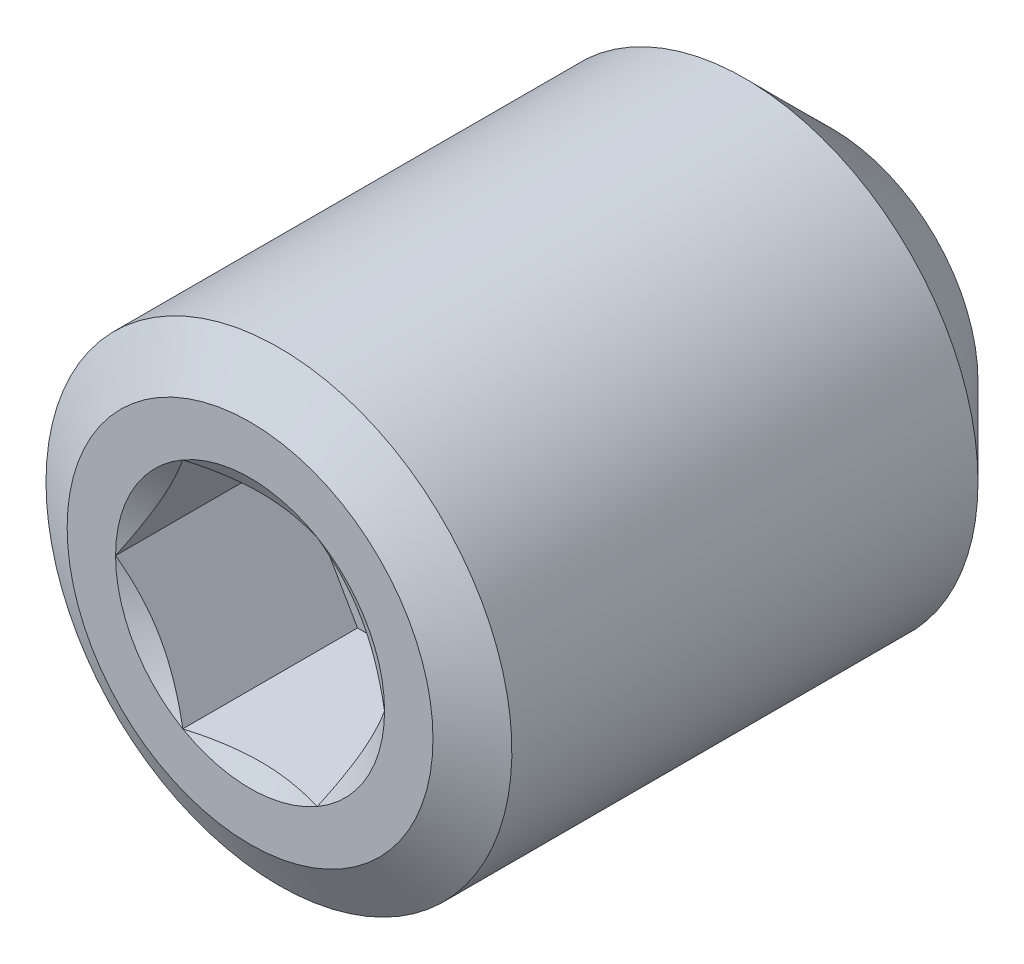
ISO-10303-21;
HEADER;
FILE_DESCRIPTION(('STEP AP214'),'2;1');
FILE_NAME('part.step','',(''),(''),'','','');
FILE_SCHEMA(('AUTOMOTIVE_DESIGN { 1 0 10303 214 1 1 1 1 }'));
ENDSEC;
DATA;
#1=APPLICATION_CONTEXT('core data for automotive mechanical design processes');
#2=APPLICATION_PROTOCOL_DEFINITION('international standard','automotive_design',2000,#1);
#3=PRODUCT_CONTEXT('',#1,'mechanical');
#4=PRODUCT('Part','Part','',(#3));
#5=PRODUCT_RELATED_PRODUCT_CATEGORY('part','',(#4));
#6=PRODUCT_DEFINITION_FORMATION('','',#4);
#7=PRODUCT_DEFINITION_CONTEXT('part definition',#1,'design');
#8=PRODUCT_DEFINITION('design','',#6,#7);
#9=PRODUCT_DEFINITION_SHAPE('','',#8);
#10=(LENGTH_UNIT() NAMED_UNIT(*) SI_UNIT(.MILLI.,.METRE.));
#11=(NAMED_UNIT(*) PLANE_ANGLE_UNIT() SI_UNIT($,.RADIAN.));
#12=(NAMED_UNIT(*) SI_UNIT($,.STERADIAN.) SOLID_ANGLE_UNIT());
#13=UNCERTAINTY_MEASURE_WITH_UNIT(LENGTH_MEASURE(1.E-05),#10,'distance_accuracy_value','');
#14=(GEOMETRIC_REPRESENTATION_CONTEXT(3) GLOBAL_UNCERTAINTY_ASSIGNED_CONTEXT((#13)) GLOBAL_UNIT_ASSIGNED_CONTEXT((#10,
#11,#12)) REPRESENTATION_CONTEXT('',''));
#15=CARTESIAN_POINT('',(0.,0.,0.));
#16=DIRECTION('',(0.,0.,1.));
#17=DIRECTION('',(1.,0.,0.));
#18=AXIS2_PLACEMENT_3D('',#15,#16,#17);
#19=CARTESIAN_POINT('',(-7.87735026918963,-0.999999999999999,10.));
#20=DIRECTION('',(0.,-1.,0.));
#21=DIRECTION('',(0.,0.,-1.));
#22=AXIS2_PLACEMENT_3D('',#19,#20,#21);
#23=PLANE('',#22);
#24=DIRECTION('',(0.,0.,1.));
#25=VECTOR('',#24,1.);
#26=CARTESIAN_POINT('',(-6.72264973081037,-0.999999999999999,10.));
#27=LINE('',#26,#25);
#28=CARTESIAN_POINT('',(-6.72264973080795,-1.00000000000603,10.0000000000346));
#29=VERTEX_POINT('',#28);
#30=CARTESIAN_POINT('',(-6.72264973081037,-0.999999999999999,8.5));
#31=VERTEX_POINT('',#30);
#32=EDGE_CURVE('E74',#29,#31,#27,.F.);
#33=ORIENTED_EDGE('',*,*,#32,.T.);
#34=DIRECTION('',(-1.,0.,0.));
#35=VECTOR('',#34,1.);
#36=CARTESIAN_POINT('',(-7.3,-0.999999999999999,8.5));
#37=LINE('',#36,#35);
#38=CARTESIAN_POINT('',(-7.87735026918963,-0.999999999999997,8.5));
#39=VERTEX_POINT('',#38);
#40=EDGE_CURVE('E261',#31,#39,#37,.T.);
#41=ORIENTED_EDGE('',*,*,#40,.T.);
#42=DIRECTION('',(0.,0.,1.));
#43=VECTOR('',#42,1.);
#44=CARTESIAN_POINT('',(-7.87735026918963,-0.999999999999997,10.));
#45=LINE('',#44,#43);
#46=CARTESIAN_POINT('',(-7.87735026919245,-0.999999999999998,10.0000000000686));
#47=VERTEX_POINT('',#46);
#48=EDGE_CURVE('E77',#39,#47,#45,.T.);
#49=ORIENTED_EDGE('',*,*,#48,.T.);
#50=CARTESIAN_POINT('',(-6.72264973081249,-0.999999999999999,10.0000000000303));
#51=CARTESIAN_POINT('',(-6.77004446291757,-0.999999999999999,9.98631688646596));
#52=CARTESIAN_POINT('',(-6.81781412942871,-0.999999999999999,9.9737896099871));
#53=CARTESIAN_POINT('',(-6.91412944760533,-0.999999999999999,9.95164920318649));
#54=CARTESIAN_POINT('',(-6.96267658445572,-0.999999999999999,9.94204259308874));
#55=CARTESIAN_POINT('',(-7.05922611584881,-0.999999999999999,9.9265940010351));
#56=CARTESIAN_POINT('',(-7.10721491698777,-0.999999999999999,9.92066965365338));
#57=CARTESIAN_POINT('',(-7.20346938392045,-0.999999999999999,9.9127165686833));
#58=CARTESIAN_POINT('',(-7.25173469196023,-0.999999999999999,9.91068360254859));
#59=CARTESIAN_POINT('',(-7.34826530804043,-0.999999999999999,9.91068360254859));
#60=CARTESIAN_POINT('',(-7.39653061608086,-0.999999999999999,9.91271656868335));
#61=CARTESIAN_POINT('',(-7.49278508301485,-0.999999999999999,9.92066965365365));
#62=CARTESIAN_POINT('',(-7.54077388415445,-0.999999999999999,9.92659400103553));
#63=CARTESIAN_POINT('',(-7.63732341554885,-0.999999999999999,9.94204259308957));
#64=CARTESIAN_POINT('',(-7.6858705523999,-0.999999999999999,9.95164920318757));
#65=CARTESIAN_POINT('',(-7.78218587057781,-0.999999999999999,9.97378960998872));
#66=CARTESIAN_POINT('',(-7.82995553708958,-0.999999999999999,9.98631688646788));
#67=CARTESIAN_POINT('',(-7.87735026919528,-0.999999999999999,10.0000000000326));
#68=B_SPLINE_CURVE_WITH_KNOTS('',3,(#50,#51,#52,#53,#54,#55,#56,#57,#58,#59,#60,#61,#62,#63,#64,
#65,#66,#67),.UNSPECIFIED.,.F.,.F.,(4,2,2,2,2,2,2,2,4),(0.,0.14803669795849,0.29640149304375,
0.44131542958406,0.586071806661001,0.730828183739914,0.875742120282205,1.02410691536954,
1.17214361333009),.UNSPECIFIED.);
#69=EDGE_CURVE('E21',#29,#47,#68,.T.);
#70=ORIENTED_EDGE('',*,*,#69,.F.);
#71=EDGE_LOOP('',(#33,#41,#49,#70));
#72=FACE_BOUND('',#71,.T.);
#73=ADVANCED_FACE('F17',(#72),#23,.F.);
#74=CARTESIAN_POINT('',(-6.72264973081037,1.,10.));
#75=DIRECTION('',(0.,1.,0.));
#76=DIRECTION('',(0.,0.,1.));
#77=AXIS2_PLACEMENT_3D('',#74,#75,#76);
#78=PLANE('',#77);
#79=DIRECTION('',(0.,0.,1.));
#80=VECTOR('',#79,1.);
#81=CARTESIAN_POINT('',(-7.87735026918963,1.,10.));
#82=LINE('',#81,#80);
#83=CARTESIAN_POINT('',(-7.87735026918372,1.00000000001023,10.0000000000431));
#84=VERTEX_POINT('',#83);
#85=CARTESIAN_POINT('',(-7.87735026918963,1.,8.5));
#86=VERTEX_POINT('',#85);
#87=EDGE_CURVE('E225',#84,#86,#82,.F.);
#88=ORIENTED_EDGE('',*,*,#87,.T.);
#89=DIRECTION('',(-1.,0.,0.));
#90=VECTOR('',#89,1.);
#91=CARTESIAN_POINT('',(-7.3,1.,8.5));
#92=LINE('',#91,#90);
#93=CARTESIAN_POINT('',(-6.72264973081037,0.999999999999999,8.5));
#94=VERTEX_POINT('',#93);
#95=EDGE_CURVE('E170',#86,#94,#92,.F.);
#96=ORIENTED_EDGE('',*,*,#95,.T.);
#97=DIRECTION('',(0.,0.,1.));
#98=VECTOR('',#97,1.);
#99=CARTESIAN_POINT('',(-6.72264973081037,0.999999999999998,10.));
#100=LINE('',#99,#98);
#101=CARTESIAN_POINT('',(-6.72264973080584,1.00000000000421,10.0000000000431));
#102=VERTEX_POINT('',#101);
#103=EDGE_CURVE('E89',#94,#102,#100,.T.);
#104=ORIENTED_EDGE('',*,*,#103,.T.);
#105=CARTESIAN_POINT('',(-7.87735026918543,1.,10.0000000000385));
#106=CARTESIAN_POINT('',(-7.82995553708064,1.,9.98631688647293));
#107=CARTESIAN_POINT('',(-7.78218587056974,1.,9.97378960999294));
#108=CARTESIAN_POINT('',(-7.68587055239344,1.,9.9516492031903));
#109=CARTESIAN_POINT('',(-7.63732341554314,1.,9.94204259309165));
#110=CARTESIAN_POINT('',(-7.54077388415032,1.,9.9265940010366));
#111=CARTESIAN_POINT('',(-7.49278508301155,1.,9.92066965365434));
#112=CARTESIAN_POINT('',(-7.39653061607918,1.,9.91271656868353));
#113=CARTESIAN_POINT('',(-7.34826530803955,1.,9.91068360254864));
#114=CARTESIAN_POINT('',(-7.25173469196029,1.,9.91068360254864));
#115=CARTESIAN_POINT('',(-7.20346938392067,1.,9.91271656868354));
#116=CARTESIAN_POINT('',(-7.10721491698833,1.,9.92066965365435));
#117=CARTESIAN_POINT('',(-7.05922611584958,1.,9.92659400103662));
#118=CARTESIAN_POINT('',(-6.96267658445678,1.,9.94204259309167));
#119=CARTESIAN_POINT('',(-6.9141294476065,1.,9.95164920319031));
#120=CARTESIAN_POINT('',(-6.81781412943023,1.,9.97378960999295));
#121=CARTESIAN_POINT('',(-6.77004446291934,1.,9.98631688647294));
#122=CARTESIAN_POINT('',(-6.72264973081457,1.,10.0000000000385));
#123=B_SPLINE_CURVE_WITH_KNOTS('',3,(#105,#106,#107,#108,#109,#110,#111,#112,#113,#114,#115,
#116,#117,#118,#119,#120,#121,#122),.UNSPECIFIED.,.F.,.F.,(4,2,2,2,2,2,2,2,4),(0.,
0.148036697958658,0.296401493044158,0.441315429584087,0.586071806660615,0.730828183737098,
0.875742120276983,1.02410691536244,1.17214361332105),.UNSPECIFIED.);
#124=EDGE_CURVE('E78',#84,#102,#123,.T.);
#125=ORIENTED_EDGE('',*,*,#124,.F.);
#126=EDGE_LOOP('',(#88,#96,#104,#125));
#127=FACE_BOUND('',#126,.T.);
#128=ADVANCED_FACE('F162',(#127),#78,.F.);
#129=CARTESIAN_POINT('',(-7.3,0.,8.5));
#130=DIRECTION('',(0.,0.,-1.));
#131=DIRECTION('',(-1.,0.,0.));
#132=AXIS2_PLACEMENT_3D('',#129,#130,#131);
#133=PLANE('',#132);
#134=ORIENTED_EDGE('',*,*,#40,.F.);
#135=DIRECTION('',(0.5,0.866025403784439,0.));
#136=VECTOR('',#135,1.);
#137=CARTESIAN_POINT('',(-6.72264973081037,-0.999999999999999,8.5));
#138=LINE('',#137,#136);
#139=CARTESIAN_POINT('',(-6.14529946162075,0.,8.5));
#140=VERTEX_POINT('',#139);
#141=EDGE_CURVE('E88',#31,#140,#138,.T.);
#142=ORIENTED_EDGE('',*,*,#141,.T.);
#143=DIRECTION('',(-0.5,0.866025403784439,0.));
#144=VECTOR('',#143,1.);
#145=CARTESIAN_POINT('',(-6.14529946162075,0.,8.5));
#146=LINE('',#145,#144);
#147=EDGE_CURVE('E251',#140,#94,#146,.T.);
#148=ORIENTED_EDGE('',*,*,#147,.T.);
#149=ORIENTED_EDGE('',*,*,#95,.F.);
#150=DIRECTION('',(-0.5,-0.866025403784439,0.));
#151=VECTOR('',#150,1.);
#152=CARTESIAN_POINT('',(-7.87735026918963,1.,8.5));
#153=LINE('',#152,#151);
#154=CARTESIAN_POINT('',(-8.45470053837925,0.,8.5));
#155=VERTEX_POINT('',#154);
#156=EDGE_CURVE('E227',#86,#155,#153,.T.);
#157=ORIENTED_EDGE('',*,*,#156,.T.);
#158=DIRECTION('',(0.5,-0.866025403784439,0.));
#159=VECTOR('',#158,1.);
#160=CARTESIAN_POINT('',(-8.45470053837925,0.,8.5));
#161=LINE('',#160,#159);
#162=EDGE_CURVE('E233',#155,#39,#161,.T.);
#163=ORIENTED_EDGE('',*,*,#162,.T.);
#164=EDGE_LOOP('',(#134,#142,#148,#149,#157,#163));
#165=FACE_BOUND('',#164,.T.);
#166=ADVANCED_FACE('F159',(#165),#133,.F.);
#167=CARTESIAN_POINT('',(-6.14529946162075,0.,10.));
#168=DIRECTION('',(0.866025403784439,0.5,0.));
#169=DIRECTION('',(-0.5,0.866025403784439,0.));
#170=AXIS2_PLACEMENT_3D('',#167,#168,#169);
#171=PLANE('',#170);
#172=ORIENTED_EDGE('',*,*,#103,.F.);
#173=ORIENTED_EDGE('',*,*,#147,.F.);
#174=DIRECTION('',(0.,0.,1.));
#175=VECTOR('',#174,1.);
#176=CARTESIAN_POINT('',(-6.14529946162075,0.,10.));
#177=LINE('',#176,#175);
#178=CARTESIAN_POINT('',(-6.14529946161431,8.97844888407203E-13,10.0000000000434));
#179=VERTEX_POINT('',#178);
#180=EDGE_CURVE('E243',#140,#179,#177,.T.);
#181=ORIENTED_EDGE('',*,*,#180,.T.);
#182=CARTESIAN_POINT('',(-6.14529946162179,1.79467155428432E-12,10.0000000000391));
#183=CARTESIAN_POINT('',(-6.17067050939324,0.0439439437832102,9.9853477726028));
#184=CARTESIAN_POINT('',(-6.19626055968811,0.0882672110621736,9.97202233858992));
#185=CARTESIAN_POINT('',(-6.24788373488103,0.177681173344338,9.94876319374054));
#186=CARTESIAN_POINT('',(-6.27391777672441,0.222773456543447,9.93883771020972));
#187=CARTESIAN_POINT('',(-6.32566323358121,0.312399216880282,9.92338797951412));
#188=CARTESIAN_POINT('',(-6.3513666891231,0.356918907808926,9.91776089383969));
#189=CARTESIAN_POINT('',(-6.40289448035908,0.446167660231436,9.91104458410664));
#190=CARTESIAN_POINT('',(-6.42871862889216,0.490896397552941,9.90994979702856));
#191=CARTESIAN_POINT('',(-6.47696828007823,0.574467244854696,9.9122331451188));
#192=CARTESIAN_POINT('',(-6.49940102298446,0.613321895321417,9.91505064264945));
#193=CARTESIAN_POINT('',(-6.54412036679432,0.690778070881227,9.92397865040011));
#194=CARTESIAN_POINT('',(-6.56640681314112,0.729379328274044,9.93009220742516));
#195=CARTESIAN_POINT('',(-6.61121828301658,0.806995070860182,9.94537491670948));
#196=CARTESIAN_POINT('',(-6.63373763791005,0.845999737689354,9.95460882114915));
#197=CARTESIAN_POINT('',(-6.67844056866225,0.923427484999393,9.97556588045897));
#198=CARTESIAN_POINT('',(-6.7006247167754,0.961851556654011,9.98728411441501));
#199=CARTESIAN_POINT('',(-6.72264973080827,0.999999999996361,10.0000000000385));
#200=B_SPLINE_CURVE_WITH_KNOTS('',3,(#182,#183,#184,#185,#186,#187,#188,#189,#190,#191,#192,
#193,#194,#195,#196,#197,#198,#199),.UNSPECIFIED.,.F.,.F.,(4,2,2,2,2,2,2,2,4),(0.,
0.158508005777772,0.31739690851222,0.472353803074636,0.627120444446607,0.761853891312511,
0.896712096892624,1.03456081123844,1.17213898675028),.UNSPECIFIED.);
#201=EDGE_CURVE('E96',#179,#102,#200,.T.);
#202=ORIENTED_EDGE('',*,*,#201,.T.);
#203=EDGE_LOOP('',(#172,#173,#181,#202));
#204=FACE_BOUND('',#203,.T.);
#205=ADVANCED_FACE('F154',(#204),#171,.F.);
#206=CARTESIAN_POINT('',(-6.72264973081037,-0.999999999999999,10.));
#207=DIRECTION('',(0.866025403784439,-0.5,0.));
#208=DIRECTION('',(0.5,0.866025403784439,0.));
#209=AXIS2_PLACEMENT_3D('',#206,#207,#208);
#210=PLANE('',#209);
#211=ORIENTED_EDGE('',*,*,#180,.F.);
#212=ORIENTED_EDGE('',*,*,#141,.F.);
#213=ORIENTED_EDGE('',*,*,#32,.F.);
#214=CARTESIAN_POINT('',(-6.72264973080814,-0.999999999996137,10.0000000000384));
#215=CARTESIAN_POINT('',(-6.69727868303671,-0.956056056214755,9.98534777260217));
#216=CARTESIAN_POINT('',(-6.67168863274185,-0.911732788935825,9.97202233858934));
#217=CARTESIAN_POINT('',(-6.62006545754897,-0.822318826653731,9.94876319374009));
#218=CARTESIAN_POINT('',(-6.59403141570561,-0.777226543454659,9.93883771020934));
#219=CARTESIAN_POINT('',(-6.54228595884886,-0.687600783117898,9.92338797951387));
#220=CARTESIAN_POINT('',(-6.51658250330699,-0.643081092189293,9.9177608938395));
#221=CARTESIAN_POINT('',(-6.46505471207106,-0.553832339766863,9.91104458410658));
#222=CARTESIAN_POINT('',(-6.43923056353801,-0.509103602445401,9.90994979702855));
#223=CARTESIAN_POINT('',(-6.39098091235194,-0.425532755143667,9.9122331451189));
#224=CARTESIAN_POINT('',(-6.3685481694457,-0.386678104676923,9.91505064264959));
#225=CARTESIAN_POINT('',(-6.32382882563582,-0.309221929117072,9.92397865040035));
#226=CARTESIAN_POINT('',(-6.30154237928901,-0.270620671724236,9.93009220742545));
#227=CARTESIAN_POINT('',(-6.25673090941353,-0.193004929138061,9.94537491670988));
#228=CARTESIAN_POINT('',(-6.23421155452005,-0.154000262308871,9.9546088211496));
#229=CARTESIAN_POINT('',(-6.18950862376783,-0.0765725149987973,9.97556588045951));
#230=CARTESIAN_POINT('',(-6.16732447565466,-0.0381484433441626,9.98728411441559));
#231=CARTESIAN_POINT('',(-6.14529946162178,-1.79570683617702E-12,10.0000000000391));
#232=B_SPLINE_CURVE_WITH_KNOTS('',3,(#214,#215,#216,#217,#218,#219,#220,#221,#222,#223,#224,
#225,#226,#227,#228,#229,#230,#231),.UNSPECIFIED.,.F.,.F.,(4,2,2,2,2,2,2,2,4),(0.,
0.158508005777613,0.317396908511899,0.472353803074164,0.627120444445985,0.761853891311975,
0.896712096892174,1.03456081123807,1.17213898675001),.UNSPECIFIED.);
#233=EDGE_CURVE('E85',#29,#179,#232,.T.);
#234=ORIENTED_EDGE('',*,*,#233,.T.);
#235=EDGE_LOOP('',(#211,#212,#213,#234));
#236=FACE_BOUND('',#235,.T.);
#237=ADVANCED_FACE('F84',(#236),#210,.F.);
#238=CARTESIAN_POINT('',(-8.45470053837925,0.,10.));
#239=DIRECTION('',(-0.866025403784439,-0.5,0.));
#240=DIRECTION('',(0.5,-0.866025403784439,0.));
#241=AXIS2_PLACEMENT_3D('',#238,#239,#240);
#242=PLANE('',#241);
#243=ORIENTED_EDGE('',*,*,#48,.F.);
#244=ORIENTED_EDGE('',*,*,#162,.F.);
#245=DIRECTION('',(0.,0.,1.));
#246=VECTOR('',#245,1.);
#247=CARTESIAN_POINT('',(-8.45470053837925,0.,10.));
#248=LINE('',#247,#246);
#249=CARTESIAN_POINT('',(-8.45470053838569,-8.95276576530151E-13,10.0000000000434));
#250=VERTEX_POINT('',#249);
#251=EDGE_CURVE('E39',#155,#250,#248,.T.);
#252=ORIENTED_EDGE('',*,*,#251,.T.);
#253=CARTESIAN_POINT('',(-8.45470053837821,-1.79199560571235E-12,10.0000000000391));
#254=CARTESIAN_POINT('',(-8.42932949060676,-0.0439439437832097,9.9853477726028));
#255=CARTESIAN_POINT('',(-8.40373944031188,-0.0882672110621755,9.97202233858992));
#256=CARTESIAN_POINT('',(-8.35211626511896,-0.177681173344345,9.94876319374054));
#257=CARTESIAN_POINT('',(-8.32608222327558,-0.222773456543456,9.93883771020971));
#258=CARTESIAN_POINT('',(-8.27433676641878,-0.312399216880292,9.92338797951412));
#259=CARTESIAN_POINT('',(-8.2486333108769,-0.356918907808933,9.91776089383969));
#260=CARTESIAN_POINT('',(-8.19710551964092,-0.446167660231439,9.91104458410664));
#261=CARTESIAN_POINT('',(-8.17128137110784,-0.490896397552941,9.90994979702856));
#262=CARTESIAN_POINT('',(-8.12303171992145,-0.574467244855243,9.91223314511882));
#263=CARTESIAN_POINT('',(-8.10059897701491,-0.613321895322513,9.91505064264953));
#264=CARTESIAN_POINT('',(-8.05587963320442,-0.69077807088341,9.92397865040041));
#265=CARTESIAN_POINT('',(-8.03359318685731,-0.729379328276767,9.93009220742561));
#266=CARTESIAN_POINT('',(-7.98878171698122,-0.806995070863996,9.94537491671032));
#267=CARTESIAN_POINT('',(-7.96626236208743,-0.845999737693719,9.95460882115022));
#268=CARTESIAN_POINT('',(-7.9215594313346,-0.923427485004842,9.97556588046056));
#269=CARTESIAN_POINT('',(-7.89937528322114,-0.961851556659992,9.98728411441689));
#270=CARTESIAN_POINT('',(-7.87735026918797,-1.00000000000287,10.0000000000407));
#271=B_SPLINE_CURVE_WITH_KNOTS('',3,(#253,#254,#255,#256,#257,#258,#259,#260,#261,#262,#263,
#264,#265,#266,#267,#268,#269,#270),.UNSPECIFIED.,.F.,.F.,(4,2,2,2,2,2,2,2,4),(0.,
0.15850800577778,0.317396908512237,0.472353803074645,0.627120444446607,0.761853891314414,
0.896712096896438,1.03456081124426,1.1721389867581),.UNSPECIFIED.);
#272=EDGE_CURVE('E95',#250,#47,#271,.T.);
#273=ORIENTED_EDGE('',*,*,#272,.T.);
#274=EDGE_LOOP('',(#243,#244,#252,#273));
#275=FACE_BOUND('',#274,.T.);
#276=ADVANCED_FACE('F153',(#275),#242,.F.);
#277=CARTESIAN_POINT('',(-7.87735026918963,1.,10.));
#278=DIRECTION('',(-0.866025403784439,0.5,0.));
#279=DIRECTION('',(-0.5,-0.866025403784439,0.));
#280=AXIS2_PLACEMENT_3D('',#277,#278,#279);
#281=PLANE('',#280);
#282=ORIENTED_EDGE('',*,*,#251,.F.);
#283=ORIENTED_EDGE('',*,*,#156,.F.);
#284=ORIENTED_EDGE('',*,*,#87,.F.);
#285=CARTESIAN_POINT('',(-7.87735026919173,0.999999999996362,10.0000000000385));
#286=CARTESIAN_POINT('',(-7.90272131696317,0.956056056214975,9.98534777260224));
#287=CARTESIAN_POINT('',(-7.92831136725802,0.911732788936042,9.97202233858941));
#288=CARTESIAN_POINT('',(-7.97993454245091,0.822318826653941,9.94876319374014));
#289=CARTESIAN_POINT('',(-8.00596858429427,0.777226543454865,9.93883771020938));
#290=CARTESIAN_POINT('',(-8.05771404115103,0.687600783118097,9.9233879795139));
#291=CARTESIAN_POINT('',(-8.0834174966929,0.643081092189487,9.91776089383952));
#292=CARTESIAN_POINT('',(-8.13494528792883,0.553832339767049,9.91104458410658));
#293=CARTESIAN_POINT('',(-8.16076943646189,0.509103602445582,9.90994979702855));
#294=CARTESIAN_POINT('',(-8.20901908764796,0.425532755143829,9.91223314511889));
#295=CARTESIAN_POINT('',(-8.23145183055422,0.386678104677071,9.91505064264958));
#296=CARTESIAN_POINT('',(-8.27617117436411,0.309221929117191,9.92397865040034));
#297=CARTESIAN_POINT('',(-8.29845762071093,0.270620671724341,9.93009220742544));
#298=CARTESIAN_POINT('',(-8.34326909058643,0.193004929138137,9.94537491670986));
#299=CARTESIAN_POINT('',(-8.36578844547992,0.154000262308932,9.95460882114958));
#300=CARTESIAN_POINT('',(-8.41049137623216,0.0765725149988283,9.9755658804595));
#301=CARTESIAN_POINT('',(-8.43267552434533,0.0381484433441791,9.98728411441559));
#302=CARTESIAN_POINT('',(-8.45470053837822,1.79821107509782E-12,10.0000000000391));
#303=B_SPLINE_CURVE_WITH_KNOTS('',3,(#285,#286,#287,#288,#289,#290,#291,#292,#293,#294,#295,
#296,#297,#298,#299,#300,#301,#302),.UNSPECIFIED.,.F.,.F.,(4,2,2,2,2,2,2,2,4),(0.,
0.158508005777631,0.317396908511934,0.472353803074215,0.627120444446051,0.76185389131209,
0.896712096892339,1.03456081123829,1.17213898675028),.UNSPECIFIED.);
#304=EDGE_CURVE('E109',#84,#250,#303,.T.);
#305=ORIENTED_EDGE('',*,*,#304,.T.);
#306=EDGE_LOOP('',(#282,#283,#284,#305));
#307=FACE_BOUND('',#306,.T.);
#308=ADVANCED_FACE('F121',(#307),#281,.F.);
#309=CARTESIAN_POINT('',(-7.3,0.,10.0000000000477));
#310=DIRECTION('',(0.,0.,1.));
#311=DIRECTION('',(1.,0.,0.));
#312=AXIS2_PLACEMENT_3D('',#309,#310,#311);
#313=CONICAL_SURFACE('',#312,1.15470053839317,1.04719755112858);
#314=ORIENTED_EDGE('',*,*,#124,.T.);
#315=CARTESIAN_POINT('',(-7.3,0.,10.0000000000477));
#316=DIRECTION('',(0.,0.,1.));
#317=DIRECTION('',(1.,0.,0.));
#318=AXIS2_PLACEMENT_3D('',#315,#316,#317);
#319=CIRCLE('',#318,1.15470053839317);
#320=EDGE_CURVE('E104',#84,#102,#319,.F.);
#321=ORIENTED_EDGE('',*,*,#320,.F.);
#322=EDGE_LOOP('',(#314,#321));
#323=FACE_BOUND('',#322,.T.);
#324=ADVANCED_FACE('F171',(#323),#313,.F.);
#325=CARTESIAN_POINT('',(-7.3,0.,10.0000000000477));
#326=DIRECTION('',(0.,0.,1.));
#327=DIRECTION('',(1.,0.,0.));
#328=AXIS2_PLACEMENT_3D('',#325,#326,#327);
#329=CONICAL_SURFACE('',#328,1.15470053839317,1.04719755120501);
#330=CARTESIAN_POINT('',(-7.3,0.,10.0000000000477));
#331=DIRECTION('',(0.,0.,1.));
#332=DIRECTION('',(1.,0.,0.));
#333=AXIS2_PLACEMENT_3D('',#330,#331,#332);
#334=CIRCLE('',#333,1.15470053839317);
#335=EDGE_CURVE('E102',#102,#179,#334,.F.);
#336=ORIENTED_EDGE('',*,*,#335,.F.);
#337=ORIENTED_EDGE('',*,*,#201,.F.);
#338=EDGE_LOOP('',(#336,#337));
#339=FACE_BOUND('',#338,.T.);
#340=ADVANCED_FACE('F140',(#339),#329,.F.);
#341=CARTESIAN_POINT('',(-7.3,0.,10.0000000000477));
#342=DIRECTION('',(0.,0.,1.));
#343=DIRECTION('',(1.,0.,0.));
#344=AXIS2_PLACEMENT_3D('',#341,#342,#343);
#345=CONICAL_SURFACE('',#344,1.15470053839317,1.04719755120501);
#346=CARTESIAN_POINT('',(-7.3,0.,10.0000000000477));
#347=DIRECTION('',(0.,0.,1.));
#348=DIRECTION('',(1.,0.,0.));
#349=AXIS2_PLACEMENT_3D('',#346,#347,#348);
#350=CIRCLE('',#349,1.15470053839317);
#351=EDGE_CURVE('E67',#179,#29,#350,.F.);
#352=ORIENTED_EDGE('',*,*,#351,.F.);
#353=ORIENTED_EDGE('',*,*,#233,.F.);
#354=EDGE_LOOP('',(#352,#353));
#355=FACE_BOUND('',#354,.T.);
#356=ADVANCED_FACE('F93',(#355),#345,.F.);
#357=CARTESIAN_POINT('',(-7.3,0.,10.0000000001046));
#358=DIRECTION('',(0.,0.,1.));
#359=DIRECTION('',(1.,0.,0.));
#360=AXIS2_PLACEMENT_3D('',#357,#358,#359);
#361=CONICAL_SURFACE('',#360,1.15470053850686,1.04719755117096);
#362=ORIENTED_EDGE('',*,*,#69,.T.);
#363=CARTESIAN_POINT('',(-7.3,0.,10.0000000001046));
#364=DIRECTION('',(0.,0.,1.));
#365=DIRECTION('',(1.,0.,0.));
#366=AXIS2_PLACEMENT_3D('',#363,#364,#365);
#367=CIRCLE('',#366,1.15470053850686);
#368=EDGE_CURVE('E59',#29,#47,#367,.F.);
#369=ORIENTED_EDGE('',*,*,#368,.F.);
#370=EDGE_LOOP('',(#362,#369));
#371=FACE_BOUND('',#370,.T.);
#372=ADVANCED_FACE('F61',(#371),#361,.F.);
#373=CARTESIAN_POINT('',(-7.3,0.,10.0000000000477));
#374=DIRECTION('',(0.,0.,1.));
#375=DIRECTION('',(1.,0.,0.));
#376=AXIS2_PLACEMENT_3D('',#373,#374,#375);
#377=CONICAL_SURFACE('',#376,1.15470053839317,1.04719755120501);
#378=CARTESIAN_POINT('',(-7.3,0.,10.0000000000477));
#379=DIRECTION('',(0.,0.,1.));
#380=DIRECTION('',(1.,0.,0.));
#381=AXIS2_PLACEMENT_3D('',#378,#379,#380);
#382=CIRCLE('',#381,1.15470053839317);
#383=EDGE_CURVE('E66',#47,#250,#382,.F.);
#384=ORIENTED_EDGE('',*,*,#383,.F.);
#385=ORIENTED_EDGE('',*,*,#272,.F.);
#386=EDGE_LOOP('',(#384,#385));
#387=FACE_BOUND('',#386,.T.);
#388=ADVANCED_FACE('F128',(#387),#377,.F.);
#389=CARTESIAN_POINT('',(-7.3,0.,10.0000000000477));
#390=DIRECTION('',(0.,0.,1.));
#391=DIRECTION('',(1.,0.,0.));
#392=AXIS2_PLACEMENT_3D('',#389,#390,#391);
#393=CONICAL_SURFACE('',#392,1.15470053839317,1.04719755120501);
#394=CARTESIAN_POINT('',(-7.3,0.,10.0000000000477));
#395=DIRECTION('',(0.,0.,1.));
#396=DIRECTION('',(1.,0.,0.));
#397=AXIS2_PLACEMENT_3D('',#394,#395,#396);
#398=CIRCLE('',#397,1.15470053839317);
#399=EDGE_CURVE('E211',#250,#84,#398,.F.);
#400=ORIENTED_EDGE('',*,*,#399,.F.);
#401=ORIENTED_EDGE('',*,*,#304,.F.);
#402=EDGE_LOOP('',(#400,#401));
#403=FACE_BOUND('',#402,.T.);
#404=ADVANCED_FACE('F124',(#403),#393,.F.);
#405=CARTESIAN_POINT('',(-7.3,1.36260026918963,10.));
#406=DIRECTION('',(0.,0.,1.));
#407=DIRECTION('',(0.,-1.,0.));
#408=AXIS2_PLACEMENT_3D('',#405,#406,#407);
#409=PLANE('',#408);
#410=ORIENTED_EDGE('',*,*,#383,.T.);
#411=ORIENTED_EDGE('',*,*,#399,.T.);
#412=ORIENTED_EDGE('',*,*,#320,.T.);
#413=ORIENTED_EDGE('',*,*,#335,.T.);
#414=ORIENTED_EDGE('',*,*,#351,.T.);
#415=ORIENTED_EDGE('',*,*,#368,.T.);
#416=EDGE_LOOP('',(#410,#411,#412,#413,#414,#415));
#417=FACE_BOUND('',#416,.T.);
#418=CARTESIAN_POINT('',(-7.3,0.,10.0000000000149));
#419=DIRECTION('',(0.,0.,-1.));
#420=DIRECTION('',(-1.,0.,0.));
#421=AXIS2_PLACEMENT_3D('',#418,#419,#420);
#422=CIRCLE('',#421,1.57050000012759);
#423=CARTESIAN_POINT('',(-8.8705000001276,0.,10.0000000000149));
#424=VERTEX_POINT('',#423);
#425=EDGE_CURVE('E207',#424,#424,#422,.T.);
#426=ORIENTED_EDGE('',*,*,#425,.F.);
#427=EDGE_LOOP('',(#426));
#428=FACE_BOUND('',#427,.T.);
#429=ADVANCED_FACE('F98',(#417,#428),#409,.T.);
#430=CARTESIAN_POINT('',(-7.3,0.625000000000001,5.));
#431=DIRECTION('',(0.,0.,-1.));
#432=DIRECTION('',(-1.,0.,0.));
#433=AXIS2_PLACEMENT_3D('',#430,#431,#432);
#434=PLANE('',#433);
#435=CARTESIAN_POINT('',(-7.3,0.,5.00000000016598));
#436=DIRECTION('',(0.,0.,1.));
#437=DIRECTION('',(1.,0.,0.));
#438=AXIS2_PLACEMENT_3D('',#435,#436,#437);
#439=CIRCLE('',#438,1.25000000014097);
#440=CARTESIAN_POINT('',(-6.04999999985903,0.,5.00000000016598));
#441=VERTEX_POINT('',#440);
#442=EDGE_CURVE('E206',#441,#441,#439,.T.);
#443=ORIENTED_EDGE('',*,*,#442,.F.);
#444=EDGE_LOOP('',(#443));
#445=FACE_BOUND('',#444,.T.);
#446=ADVANCED_FACE('F197',(#445),#434,.T.);
#447=CARTESIAN_POINT('',(-7.3,0.,9.75202805938125));
#448=DIRECTION('',(0.,0.,-1.));
#449=DIRECTION('',(-1.,0.,0.));
#450=AXIS2_PLACEMENT_3D('',#447,#448,#449);
#451=CONICAL_SURFACE('',#450,2.00000000012324,1.04719755116297);
#452=ORIENTED_EDGE('',*,*,#425,.T.);
#453=EDGE_LOOP('',(#452));
#454=FACE_BOUND('',#453,.T.);
#455=CARTESIAN_POINT('',(-7.3,0.,9.75202805938306));
#456=DIRECTION('',(0.,0.,1.));
#457=DIRECTION('',(0.,-1.,0.));
#458=AXIS2_PLACEMENT_3D('',#455,#456,#457);
#459=CIRCLE('',#458,2.);
#460=CARTESIAN_POINT('',(-7.3,-2.,9.75202805938306));
#461=VERTEX_POINT('',#460);
#462=EDGE_CURVE('E31',#461,#461,#459,.F.);
#463=ORIENTED_EDGE('',*,*,#462,.F.);
#464=EDGE_LOOP('',(#463));
#465=FACE_BOUND('',#464,.T.);
#466=ADVANCED_FACE('F190',(#454,#465),#451,.T.);
#467=CARTESIAN_POINT('',(-7.3,0.,5.74999999992087));
#468=DIRECTION('',(0.,0.,1.));
#469=DIRECTION('',(1.,0.,0.));
#470=AXIS2_PLACEMENT_3D('',#467,#468,#469);
#471=CONICAL_SURFACE('',#470,1.99999999995271,0.785398163435344);
#472=ORIENTED_EDGE('',*,*,#442,.T.);
#473=EDGE_LOOP('',(#472));
#474=FACE_BOUND('',#473,.T.);
#475=CARTESIAN_POINT('',(-7.3,0.,5.75));
#476=DIRECTION('',(0.,0.,1.));
#477=DIRECTION('',(0.,-1.,0.));
#478=AXIS2_PLACEMENT_3D('',#475,#476,#477);
#479=CIRCLE('',#478,2.);
#480=CARTESIAN_POINT('',(-7.3,-2.,5.75));
#481=VERTEX_POINT('',#480);
#482=EDGE_CURVE('E11',#481,#481,#479,.T.);
#483=ORIENTED_EDGE('',*,*,#482,.F.);
#484=EDGE_LOOP('',(#483));
#485=FACE_BOUND('',#484,.T.);
#486=ADVANCED_FACE('F184',(#474,#485),#471,.T.);
#487=CARTESIAN_POINT('',(-7.3,0.,7.75101402969153));
#488=DIRECTION('',(0.,0.,1.));
#489=DIRECTION('',(0.,-1.,0.));
#490=AXIS2_PLACEMENT_3D('',#487,#488,#489);
#491=CYLINDRICAL_SURFACE('',#490,2.);
#492=ORIENTED_EDGE('',*,*,#462,.T.);
#493=EDGE_LOOP('',(#492));
#494=FACE_BOUND('',#493,.T.);
#495=ORIENTED_EDGE('',*,*,#482,.T.);
#496=EDGE_LOOP('',(#495));
#497=FACE_BOUND('',#496,.T.);
#498=ADVANCED_FACE('F182',(#494,#497),#491,.T.);
#499=CLOSED_SHELL('',(#73,#128,#166,#205,#237,#276,#308,#324,#340,#356,#372,#388,#404,#429,#446,
#466,#486,#498));
#500=MANIFOLD_SOLID_BREP('B1',#499);
#501=ADVANCED_BREP_SHAPE_REPRESENTATION('',(#18,#500),#14);
#502=SHAPE_DEFINITION_REPRESENTATION(#9,#501);
ENDSEC;
END-ISO-10303-21;
